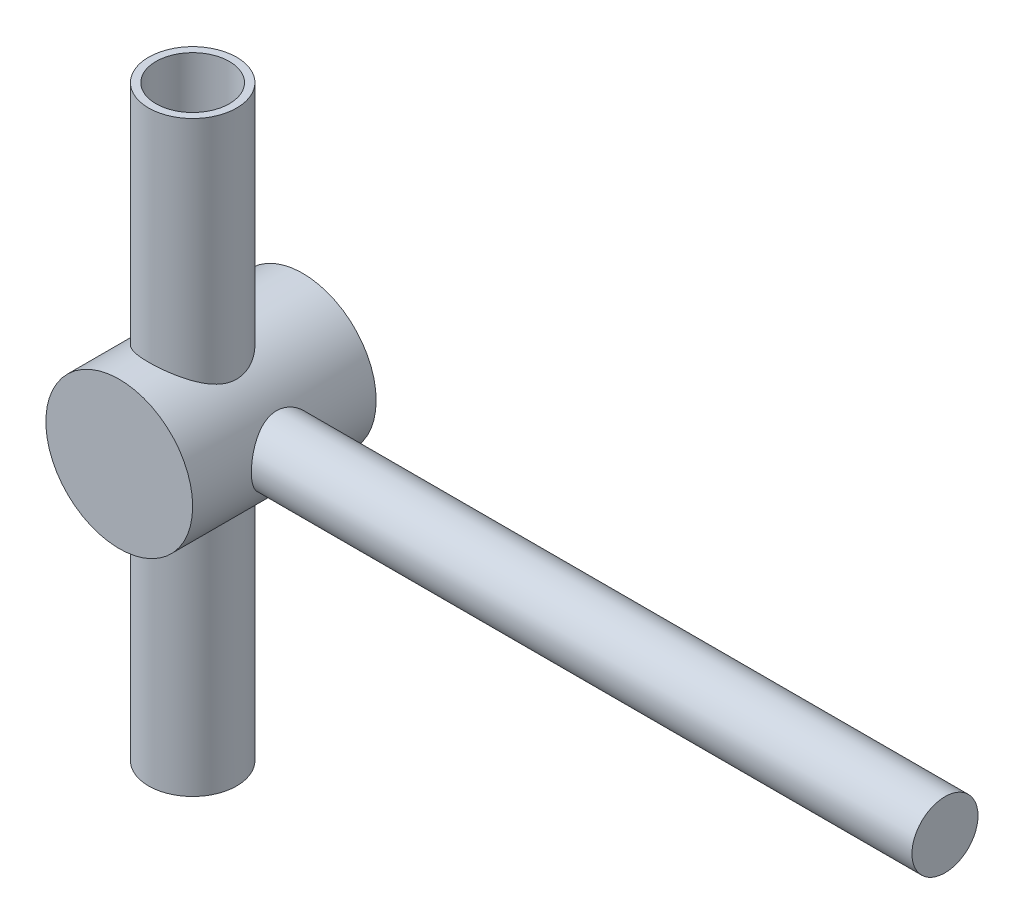
ISO-10303-21;
HEADER;
FILE_DESCRIPTION(('STEP AP214'),'2;1');
FILE_NAME('part.step','',(''),(''),'','','');
FILE_SCHEMA(('AUTOMOTIVE_DESIGN { 1 0 10303 214 1 1 1 1 }'));
ENDSEC;
DATA;
#1=APPLICATION_CONTEXT('core data for automotive mechanical design processes');
#2=APPLICATION_PROTOCOL_DEFINITION('international standard','automotive_design',2000,#1);
#3=PRODUCT_CONTEXT('',#1,'mechanical');
#4=PRODUCT('Part','Part','',(#3));
#5=PRODUCT_RELATED_PRODUCT_CATEGORY('part','',(#4));
#6=PRODUCT_DEFINITION_FORMATION('','',#4);
#7=PRODUCT_DEFINITION_CONTEXT('part definition',#1,'design');
#8=PRODUCT_DEFINITION('design','',#6,#7);
#9=PRODUCT_DEFINITION_SHAPE('','',#8);
#10=(LENGTH_UNIT() NAMED_UNIT(*) SI_UNIT(.MILLI.,.METRE.));
#11=(NAMED_UNIT(*) PLANE_ANGLE_UNIT() SI_UNIT($,.RADIAN.));
#12=(NAMED_UNIT(*) SI_UNIT($,.STERADIAN.) SOLID_ANGLE_UNIT());
#13=UNCERTAINTY_MEASURE_WITH_UNIT(LENGTH_MEASURE(1.E-05),#10,'distance_accuracy_value','');
#14=(GEOMETRIC_REPRESENTATION_CONTEXT(3) GLOBAL_UNCERTAINTY_ASSIGNED_CONTEXT((#13)) GLOBAL_UNIT_ASSIGNED_CONTEXT((#10,
#11,#12)) REPRESENTATION_CONTEXT('',''));
#15=CARTESIAN_POINT('',(0.,0.,0.));
#16=DIRECTION('',(0.,0.,1.));
#17=DIRECTION('',(1.,0.,0.));
#18=AXIS2_PLACEMENT_3D('',#15,#16,#17);
#19=CARTESIAN_POINT('',(0.,20.001,1.25));
#20=DIRECTION('',(0.,-1.,0.));
#21=DIRECTION('',(0.,0.,-1.));
#22=AXIS2_PLACEMENT_3D('',#19,#20,#21);
#23=CYLINDRICAL_SURFACE('',#22,2.5);
#24=CARTESIAN_POINT('',(0.,20.,1.25));
#25=DIRECTION('',(0.,1.,0.));
#26=DIRECTION('',(0.,0.,1.));
#27=AXIS2_PLACEMENT_3D('',#24,#25,#26);
#28=CIRCLE('',#27,2.5);
#29=CARTESIAN_POINT('',(0.,20.,3.75));
#30=VERTEX_POINT('',#29);
#31=EDGE_CURVE('E71',#30,#30,#28,.T.);
#32=ORIENTED_EDGE('',*,*,#31,.T.);
#33=EDGE_LOOP('',(#32));
#34=FACE_BOUND('',#33,.T.);
#35=CARTESIAN_POINT('',(0.,3.75,-1.25));
#36=CARTESIAN_POINT('',(0.125601374662479,3.7499987655971,-1.24999844522486));
#37=CARTESIAN_POINT('',(0.251210147375107,3.74363456413888,-1.24048193681508));
#38=CARTESIAN_POINT('',(0.498417534655946,3.7188086257994,-1.20300452089375));
#39=CARTESIAN_POINT('',(0.620014216592752,3.7003411455889,-1.17503485682461));
#40=CARTESIAN_POINT('',(0.855265062174912,3.65313090481999,-1.10236519336202));
#41=CARTESIAN_POINT('',(0.968953504127329,3.62443628501457,-1.0577435320027));
#42=CARTESIAN_POINT('',(1.18676920045378,3.55907675712476,-0.953670838904247));
#43=CARTESIAN_POINT('',(1.29089506362946,3.52241069193042,-0.894217654082859));
#44=CARTESIAN_POINT('',(1.49660584979873,3.44034160696704,-0.756678815317382));
#45=CARTESIAN_POINT('',(1.59722537477683,3.39446121700526,-0.677440170576138));
#46=CARTESIAN_POINT('',(1.78466006292512,3.2997789162835,-0.505337442677234));
#47=CARTESIAN_POINT('',(1.87145507131621,3.25097288024374,-0.412453838703281));
#48=CARTESIAN_POINT('',(2.0427787194828,3.146603307578,-0.198684539325881));
#49=CARTESIAN_POINT('',(2.12478982891588,3.09118834898155,-0.0756929331889074));
#50=CARTESIAN_POINT('',(2.2668794632946,2.98855184215071,0.18545422175192));
#51=CARTESIAN_POINT('',(2.32699591797102,2.94131619949061,0.323583001883774));
#52=CARTESIAN_POINT('',(2.40842543754358,2.87470333297752,0.570889116826573));
#53=CARTESIAN_POINT('',(2.43593059042228,2.85122034863728,0.676910566107014));
#54=CARTESIAN_POINT('',(2.47688272234313,2.81572462076277,0.893430630912453));
#55=CARTESIAN_POINT('',(2.4903539331615,2.80369210933207,1.00392118589857));
#56=CARTESIAN_POINT('',(2.50239205175334,2.79295757007021,1.22684347357962));
#57=CARTESIAN_POINT('',(2.50089803644892,2.79431003187748,1.33928127933699));
#58=CARTESIAN_POINT('',(2.48296976668709,2.8102471936467,1.56204371685318));
#59=CARTESIAN_POINT('',(2.46652285482348,2.82484310397133,1.67236647745813));
#60=CARTESIAN_POINT('',(2.42081242764785,2.86408982450889,1.88308381414061));
#61=CARTESIAN_POINT('',(2.39214639324732,2.88826860271568,1.98370167022043));
#62=CARTESIAN_POINT('',(2.32337648204614,2.94387028531605,2.1787796140132));
#63=CARTESIAN_POINT('',(2.28326884153759,2.97529557279046,2.27323766287964));
#64=CARTESIAN_POINT('',(2.1834227342476,3.04955245519594,2.47378174408541));
#65=CARTESIAN_POINT('',(2.12135065377971,3.09340397188508,2.57832487557415));
#66=CARTESIAN_POINT('',(1.98336200545358,3.18364422154056,2.77672924413694));
#67=CARTESIAN_POINT('',(1.90742836248812,3.23003603382942,2.87057707221127));
#68=CARTESIAN_POINT('',(1.72476456653744,3.33179179709175,3.06567818199372));
#69=CARTESIAN_POINT('',(1.61492422854798,3.38693430901902,3.16416756085065));
#70=CARTESIAN_POINT('',(1.37750999884782,3.49022625830314,3.34149561817591));
#71=CARTESIAN_POINT('',(1.24995287417908,3.53838222059764,3.4203526817619));
#72=CARTESIAN_POINT('',(1.00607228387111,3.61431755113188,3.54184714827805));
#73=CARTESIAN_POINT('',(0.892447054215008,3.64424076456987,3.58855420417353));
#74=CARTESIAN_POINT('',(0.657545054919234,3.69384648788061,3.66513115703186));
#75=CARTESIAN_POINT('',(0.536274848752032,3.71353765159413,3.69501528391531));
#76=CARTESIAN_POINT('',(0.288731816465386,3.74094852696027,3.73645145654746));
#77=CARTESIAN_POINT('',(0.162439764917713,3.74861653076488,3.74792432617282));
#78=CARTESIAN_POINT('',(-0.0905518992366955,3.75103893706429,3.75155886070277));
#79=CARTESIAN_POINT('',(-0.217251482733301,3.74579424232041,3.74372187561098));
#80=CARTESIAN_POINT('',(-0.458069646505276,3.72374486780342,3.71046993054755));
#81=CARTESIAN_POINT('',(-0.572446805848923,3.70777807987784,3.68632837780595));
#82=CARTESIAN_POINT('',(-0.795145490534314,3.66648061606044,3.62300539248395));
#83=CARTESIAN_POINT('',(-0.903466046964159,3.64114844683731,3.58382156133983));
#84=CARTESIAN_POINT('',(-1.11833093808224,3.58120440661452,3.48918462869376));
#85=CARTESIAN_POINT('',(-1.22437023078828,3.5461233766975,3.43288980739732));
#86=CARTESIAN_POINT('',(-1.42585377994761,3.47002319514369,3.30695838756752));
#87=CARTESIAN_POINT('',(-1.52129143525484,3.42900038004855,3.23731354933614));
#88=CARTESIAN_POINT('',(-1.71481806852475,3.33693183316869,3.07424016480155));
#89=CARTESIAN_POINT('',(-1.81093984460234,3.28532696000533,2.97879217489989));
#90=CARTESIAN_POINT('',(-1.98667460088534,3.1821396635712,2.77361071255986));
#91=CARTESIAN_POINT('',(-2.06627617078001,3.13055728021079,2.6638674511391));
#92=CARTESIAN_POINT('',(-2.20155970680725,3.03674598714348,2.44107198401835));
#93=CARTESIAN_POINT('',(-2.25869545135382,2.99409496286157,2.32908495809515));
#94=CARTESIAN_POINT('',(-2.35620267196513,2.9179871782867,2.09515918452241));
#95=CARTESIAN_POINT('',(-2.39660432181497,2.88451390647318,1.97323882740531));
#96=CARTESIAN_POINT('',(-2.4529480426708,2.83666510240559,1.7442943907711));
#97=CARTESIAN_POINT('',(-2.47198246736887,2.81993747568526,1.63853523685261));
#98=CARTESIAN_POINT('',(-2.4962400762487,2.79849333006088,1.42428339915352));
#99=CARTESIAN_POINT('',(-2.50147826174327,2.79376376529467,1.31579381404578));
#100=CARTESIAN_POINT('',(-2.49779901658417,2.79705251592872,1.09919617612347));
#101=CARTESIAN_POINT('',(-2.48887320407014,2.80507837964135,0.991088387194108));
#102=CARTESIAN_POINT('',(-2.45746249587724,2.83263064923783,0.778320600438362));
#103=CARTESIAN_POINT('',(-2.434959510753,2.85217239741457,0.673665399183417));
#104=CARTESIAN_POINT('',(-2.36991280115224,2.9065855762677,0.442860964386077));
#105=CARTESIAN_POINT('',(-2.32362673285444,2.94415428483887,0.31841513859536));
#106=CARTESIAN_POINT('',(-2.21355718508727,3.0277768987025,0.0806416775555785));
#107=CARTESIAN_POINT('',(-2.14974913954079,3.07384268703843,-0.032670042385189));
#108=CARTESIAN_POINT('',(-2.0049761800668,3.17021527415998,-0.249103204134624));
#109=CARTESIAN_POINT('',(-1.9237201109137,3.22058400672638,-0.35200161476858));
#110=CARTESIAN_POINT('',(-1.74590586583933,3.32035210438942,-0.544149913855851));
#111=CARTESIAN_POINT('',(-1.64934300170333,3.36975116726592,-0.633395604199278));
#112=CARTESIAN_POINT('',(-1.4267842240515,3.47040151023036,-0.808403729442049));
#113=CARTESIAN_POINT('',(-1.29855304909225,3.52090087508118,-0.89182743680491));
#114=CARTESIAN_POINT('',(-1.09415972519334,3.58754498626928,-0.999166107287314));
#115=CARTESIAN_POINT('',(-1.0240248219925,3.60824136009039,-1.03197827055557));
#116=CARTESIAN_POINT('',(-0.880185986539609,3.6459974834269,-1.09122204927387));
#117=CARTESIAN_POINT('',(-0.806483318581939,3.66305850977514,-1.11765590539212));
#118=CARTESIAN_POINT('',(-0.614355982978067,3.70124643764869,-1.17641240787363));
#119=CARTESIAN_POINT('',(-0.493782057953473,3.71938704111942,-1.20388054231437));
#120=CARTESIAN_POINT('',(-0.24880587617304,3.74375996040397,-1.24066829102143));
#121=CARTESIAN_POINT('',(-0.124406567070928,3.7500012226604,-1.25000153998504));
#122=CARTESIAN_POINT('',(0.,3.75,-1.25));
#123=B_SPLINE_CURVE_WITH_KNOTS('',3,(#35,#36,#37,#38,#39,#40,#41,#42,#43,#44,#45,#46,#47,#48,
#49,#50,#51,#52,#53,#54,#55,#56,#57,#58,#59,#60,#61,#62,#63,#64,#65,#66,#67,#68,#69,#70,#71,#72,
#73,#74,#75,#76,#77,#78,#79,#80,#81,#82,#83,#84,#85,#86,#87,#88,#89,#90,#91,#92,#93,#94,#95,#96,
#97,#98,#99,#100,#101,#102,#103,#104,#105,#106,#107,#108,#109,#110,#111,#112,#113,#114,#115,
#116,#117,#118,#119,#120,#121,#122),.UNSPECIFIED.,.T.,.F.,(4,2,2,2,2,2,2,2,2,2,2,2,2,2,2,2,2,2,
2,2,2,2,2,2,2,2,2,2,2,2,2,2,2,2,2,2,2,2,2,2,2,2,2,4),(0.,0.376316533131749,0.75281176793586,
1.12755769148779,1.50235804834233,1.90896286250696,2.31615514505398,2.78758354119978,
3.25819131806799,3.59292117095036,3.92707209807261,4.26258389669222,4.5983799657919,
4.91936077752086,5.24044729764504,5.62684468334248,6.01372129733227,6.48398693129096,
6.95381050384859,7.33155109629103,7.70897168936672,8.08801104125969,8.46702389424924,
8.81941355998746,9.17185943930994,9.54565433545051,9.9196806868966,10.3528522018477,
10.7863219147785,11.1831241913875,11.5792078330906,11.9040506002832,12.2285400042452,
12.5532215036384,12.8783365482366,13.290082608884,13.702408917306,14.1222405651376,
14.5422010497084,15.0224418945669,15.2625373178026,15.5025482734883,15.8755655835623,
16.2483023322226),.UNSPECIFIED.);
#124=CARTESIAN_POINT('',(0.,3.75,3.75));
#125=VERTEX_POINT('',#124);
#126=EDGE_CURVE('E11',#125,#125,#123,.T.);
#127=ORIENTED_EDGE('',*,*,#126,.T.);
#128=EDGE_LOOP('',(#127));
#129=FACE_BOUND('',#128,.T.);
#130=ADVANCED_FACE('F34',(#34,#129),#23,.F.);
#131=CARTESIAN_POINT('',(0.,-20.,1.25));
#132=DIRECTION('',(0.,1.,0.));
#133=DIRECTION('',(0.,0.,1.));
#134=AXIS2_PLACEMENT_3D('',#131,#132,#133);
#135=CIRCLE('',#134,2.5);
#136=CARTESIAN_POINT('',(0.,-20.,3.75));
#137=VERTEX_POINT('',#136);
#138=EDGE_CURVE('E60',#137,#137,#135,.T.);
#139=ORIENTED_EDGE('',*,*,#138,.F.);
#140=EDGE_LOOP('',(#139));
#141=FACE_BOUND('',#140,.T.);
#142=CARTESIAN_POINT('',(0.,-3.75,-1.25));
#143=CARTESIAN_POINT('',(-0.125601374662479,-3.7499987655971,-1.24999844522486));
#144=CARTESIAN_POINT('',(-0.251210147375107,-3.74363456413888,-1.24048193681508));
#145=CARTESIAN_POINT('',(-0.498417534655946,-3.7188086257994,-1.20300452089375));
#146=CARTESIAN_POINT('',(-0.620014216592752,-3.7003411455889,-1.17503485682461));
#147=CARTESIAN_POINT('',(-0.855265062174912,-3.65313090481999,-1.10236519336202));
#148=CARTESIAN_POINT('',(-0.968953504127329,-3.62443628501457,-1.0577435320027));
#149=CARTESIAN_POINT('',(-1.18676920045378,-3.55907675712476,-0.953670838904247));
#150=CARTESIAN_POINT('',(-1.29089506362946,-3.52241069193042,-0.894217654082859));
#151=CARTESIAN_POINT('',(-1.49660584979873,-3.44034160696704,-0.756678815317382));
#152=CARTESIAN_POINT('',(-1.59722537477683,-3.39446121700526,-0.677440170576138));
#153=CARTESIAN_POINT('',(-1.78466006292512,-3.2997789162835,-0.505337442677234));
#154=CARTESIAN_POINT('',(-1.87145507131621,-3.25097288024374,-0.412453838703281));
#155=CARTESIAN_POINT('',(-2.0427787194828,-3.146603307578,-0.198684539325881));
#156=CARTESIAN_POINT('',(-2.12478982891588,-3.09118834898155,-0.0756929331889074));
#157=CARTESIAN_POINT('',(-2.2668794632946,-2.98855184215071,0.18545422175192));
#158=CARTESIAN_POINT('',(-2.32699591797102,-2.94131619949061,0.323583001883774));
#159=CARTESIAN_POINT('',(-2.40842543754358,-2.87470333297752,0.570889116826573));
#160=CARTESIAN_POINT('',(-2.43593059042228,-2.85122034863728,0.676910566107014));
#161=CARTESIAN_POINT('',(-2.47688272234313,-2.81572462076277,0.893430630912453));
#162=CARTESIAN_POINT('',(-2.4903539331615,-2.80369210933207,1.00392118589857));
#163=CARTESIAN_POINT('',(-2.50239205175334,-2.79295757007021,1.22684347357962));
#164=CARTESIAN_POINT('',(-2.50089803644892,-2.79431003187748,1.33928127933699));
#165=CARTESIAN_POINT('',(-2.48296976668709,-2.8102471936467,1.56204371685318));
#166=CARTESIAN_POINT('',(-2.46652285482348,-2.82484310397133,1.67236647745813));
#167=CARTESIAN_POINT('',(-2.42081242764785,-2.86408982450889,1.88308381414061));
#168=CARTESIAN_POINT('',(-2.39214639324732,-2.88826860271568,1.98370167022043));
#169=CARTESIAN_POINT('',(-2.32337648204614,-2.94387028531605,2.1787796140132));
#170=CARTESIAN_POINT('',(-2.28326884153759,-2.97529557279046,2.27323766287964));
#171=CARTESIAN_POINT('',(-2.1834227342476,-3.04955245519594,2.47378174408541));
#172=CARTESIAN_POINT('',(-2.12135065377971,-3.09340397188508,2.57832487557415));
#173=CARTESIAN_POINT('',(-1.98336200545358,-3.18364422154056,2.77672924413694));
#174=CARTESIAN_POINT('',(-1.90742836248812,-3.23003603382942,2.87057707221127));
#175=CARTESIAN_POINT('',(-1.72476456653744,-3.33179179709175,3.06567818199372));
#176=CARTESIAN_POINT('',(-1.61492422854798,-3.38693430901902,3.16416756085065));
#177=CARTESIAN_POINT('',(-1.37750999884782,-3.49022625830314,3.34149561817591));
#178=CARTESIAN_POINT('',(-1.24995287417908,-3.53838222059764,3.4203526817619));
#179=CARTESIAN_POINT('',(-1.00607228387111,-3.61431755113188,3.54184714827805));
#180=CARTESIAN_POINT('',(-0.892447054215008,-3.64424076456987,3.58855420417353));
#181=CARTESIAN_POINT('',(-0.657545054919234,-3.69384648788061,3.66513115703186));
#182=CARTESIAN_POINT('',(-0.536274848752032,-3.71353765159413,3.69501528391531));
#183=CARTESIAN_POINT('',(-0.288731816465386,-3.74094852696027,3.73645145654746));
#184=CARTESIAN_POINT('',(-0.162439764917713,-3.74861653076488,3.74792432617282));
#185=CARTESIAN_POINT('',(0.0905518992366955,-3.75103893706429,3.75155886070277));
#186=CARTESIAN_POINT('',(0.217251482733301,-3.74579424232041,3.74372187561098));
#187=CARTESIAN_POINT('',(0.458069646505276,-3.72374486780342,3.71046993054755));
#188=CARTESIAN_POINT('',(0.572446805848923,-3.70777807987784,3.68632837780595));
#189=CARTESIAN_POINT('',(0.795145490534314,-3.66648061606044,3.62300539248395));
#190=CARTESIAN_POINT('',(0.903466046964159,-3.64114844683731,3.58382156133983));
#191=CARTESIAN_POINT('',(1.11833093808224,-3.58120440661452,3.48918462869376));
#192=CARTESIAN_POINT('',(1.22437023078828,-3.5461233766975,3.43288980739732));
#193=CARTESIAN_POINT('',(1.42585377994761,-3.47002319514369,3.30695838756752));
#194=CARTESIAN_POINT('',(1.52129143525484,-3.42900038004855,3.23731354933614));
#195=CARTESIAN_POINT('',(1.71481806852475,-3.33693183316869,3.07424016480155));
#196=CARTESIAN_POINT('',(1.81093984460234,-3.28532696000533,2.97879217489989));
#197=CARTESIAN_POINT('',(1.98667460088534,-3.1821396635712,2.77361071255986));
#198=CARTESIAN_POINT('',(2.06627617078001,-3.13055728021079,2.6638674511391));
#199=CARTESIAN_POINT('',(2.20155970680725,-3.03674598714348,2.44107198401835));
#200=CARTESIAN_POINT('',(2.25869545135382,-2.99409496286157,2.32908495809515));
#201=CARTESIAN_POINT('',(2.35620267196513,-2.9179871782867,2.09515918452241));
#202=CARTESIAN_POINT('',(2.39660432181497,-2.88451390647318,1.97323882740531));
#203=CARTESIAN_POINT('',(2.4529480426708,-2.83666510240559,1.7442943907711));
#204=CARTESIAN_POINT('',(2.47198246736887,-2.81993747568526,1.63853523685261));
#205=CARTESIAN_POINT('',(2.4962400762487,-2.79849333006088,1.42428339915352));
#206=CARTESIAN_POINT('',(2.50147826174327,-2.79376376529467,1.31579381404578));
#207=CARTESIAN_POINT('',(2.49779901658417,-2.79705251592872,1.09919617612347));
#208=CARTESIAN_POINT('',(2.48887320407014,-2.80507837964135,0.991088387194108));
#209=CARTESIAN_POINT('',(2.45746249587724,-2.83263064923783,0.778320600438362));
#210=CARTESIAN_POINT('',(2.434959510753,-2.85217239741457,0.673665399183417));
#211=CARTESIAN_POINT('',(2.36991280115224,-2.9065855762677,0.442860964386077));
#212=CARTESIAN_POINT('',(2.32362673285444,-2.94415428483887,0.31841513859536));
#213=CARTESIAN_POINT('',(2.21355718508727,-3.0277768987025,0.0806416775555785));
#214=CARTESIAN_POINT('',(2.14974913954079,-3.07384268703843,-0.032670042385189));
#215=CARTESIAN_POINT('',(2.0049761800668,-3.17021527415998,-0.249103204134624));
#216=CARTESIAN_POINT('',(1.9237201109137,-3.22058400672638,-0.35200161476858));
#217=CARTESIAN_POINT('',(1.74590586583933,-3.32035210438942,-0.544149913855851));
#218=CARTESIAN_POINT('',(1.64934300170333,-3.36975116726592,-0.633395604199278));
#219=CARTESIAN_POINT('',(1.4267842240515,-3.47040151023036,-0.808403729442049));
#220=CARTESIAN_POINT('',(1.29855304909225,-3.52090087508118,-0.89182743680491));
#221=CARTESIAN_POINT('',(1.09415972519334,-3.58754498626928,-0.999166107287314));
#222=CARTESIAN_POINT('',(1.0240248219925,-3.60824136009039,-1.03197827055557));
#223=CARTESIAN_POINT('',(0.880185986539609,-3.6459974834269,-1.09122204927387));
#224=CARTESIAN_POINT('',(0.806483318581939,-3.66305850977514,-1.11765590539212));
#225=CARTESIAN_POINT('',(0.614355982978067,-3.70124643764869,-1.17641240787363));
#226=CARTESIAN_POINT('',(0.493782057953473,-3.71938704111942,-1.20388054231437));
#227=CARTESIAN_POINT('',(0.24880587617304,-3.74375996040397,-1.24066829102143));
#228=CARTESIAN_POINT('',(0.124406567070928,-3.7500012226604,-1.25000153998504));
#229=CARTESIAN_POINT('',(0.,-3.75,-1.25));
#230=B_SPLINE_CURVE_WITH_KNOTS('',3,(#142,#143,#144,#145,#146,#147,#148,#149,#150,#151,#152,
#153,#154,#155,#156,#157,#158,#159,#160,#161,#162,#163,#164,#165,#166,#167,#168,#169,#170,#171,
#172,#173,#174,#175,#176,#177,#178,#179,#180,#181,#182,#183,#184,#185,#186,#187,#188,#189,#190,
#191,#192,#193,#194,#195,#196,#197,#198,#199,#200,#201,#202,#203,#204,#205,#206,#207,#208,#209,
#210,#211,#212,#213,#214,#215,#216,#217,#218,#219,#220,#221,#222,#223,#224,#225,#226,#227,#228,
#229),.UNSPECIFIED.,.T.,.F.,(4,2,2,2,2,2,2,2,2,2,2,2,2,2,2,2,2,2,2,2,2,2,2,2,2,2,2,2,2,2,2,2,2,
2,2,2,2,2,2,2,2,2,2,4),(0.,0.376316533131749,0.75281176793586,1.12755769148779,1.50235804834233,
1.90896286250696,2.31615514505398,2.78758354119978,3.25819131806799,3.59292117095036,
3.92707209807261,4.26258389669222,4.5983799657919,4.91936077752086,5.24044729764504,
5.62684468334248,6.01372129733227,6.48398693129096,6.95381050384859,7.33155109629103,
7.70897168936672,8.08801104125969,8.46702389424924,8.81941355998746,9.17185943930994,
9.54565433545051,9.9196806868966,10.3528522018477,10.7863219147785,11.1831241913875,
11.5792078330906,11.9040506002832,12.2285400042452,12.5532215036384,12.8783365482366,
13.290082608884,13.702408917306,14.1222405651376,14.5422010497084,15.0224418945669,
15.2625373178026,15.5025482734883,15.8755655835623,16.2483023322226),.UNSPECIFIED.);
#231=CARTESIAN_POINT('',(0.,-3.75,3.75));
#232=VERTEX_POINT('',#231);
#233=EDGE_CURVE('E47',#232,#232,#230,.T.);
#234=ORIENTED_EDGE('',*,*,#233,.T.);
#235=EDGE_LOOP('',(#234));
#236=FACE_BOUND('',#235,.T.);
#237=ADVANCED_FACE('F122',(#141,#236),#23,.F.);
#238=CARTESIAN_POINT('',(0.,0.,6.25));
#239=DIRECTION('',(0.,0.,-1.));
#240=DIRECTION('',(-1.,0.,0.));
#241=AXIS2_PLACEMENT_3D('',#238,#239,#240);
#242=CYLINDRICAL_SURFACE('',#241,5.);
#243=CARTESIAN_POINT('',(0.,0.,6.25));
#244=DIRECTION('',(0.,0.,1.));
#245=DIRECTION('',(1.,0.,0.));
#246=AXIS2_PLACEMENT_3D('',#243,#244,#245);
#247=CIRCLE('',#246,5.);
#248=CARTESIAN_POINT('',(5.,0.,6.25));
#249=VERTEX_POINT('',#248);
#250=EDGE_CURVE('E84',#249,#249,#247,.T.);
#251=ORIENTED_EDGE('',*,*,#250,.F.);
#252=EDGE_LOOP('',(#251));
#253=FACE_BOUND('',#252,.T.);
#254=CARTESIAN_POINT('',(0.,0.,-6.25));
#255=DIRECTION('',(0.,0.,1.));
#256=DIRECTION('',(1.,0.,0.));
#257=AXIS2_PLACEMENT_3D('',#254,#255,#256);
#258=CIRCLE('',#257,5.);
#259=CARTESIAN_POINT('',(5.,0.,-6.25));
#260=VERTEX_POINT('',#259);
#261=EDGE_CURVE('E81',#260,#260,#258,.T.);
#262=ORIENTED_EDGE('',*,*,#261,.T.);
#263=EDGE_LOOP('',(#262));
#264=FACE_BOUND('',#263,.T.);
#265=CARTESIAN_POINT('',(0.,-5.,-1.75));
#266=CARTESIAN_POINT('',(0.0767697294351705,-4.99999907546385,-1.74999894375546));
#267=CARTESIAN_POINT('',(0.153562134518387,-4.99822567812271,-1.74704640642993));
#268=CARTESIAN_POINT('',(0.306548487758715,-4.99118362570631,-1.73528576702026));
#269=CARTESIAN_POINT('',(0.382742059346592,-4.98591292553957,-1.72647423881177));
#270=CARTESIAN_POINT('',(0.609808130024627,-4.96499345352549,-1.69135144053687));
#271=CARTESIAN_POINT('',(0.758981863291667,-4.94423772571335,-1.65635229756656));
#272=CARTESIAN_POINT('',(1.04754167363585,-4.89123238995897,-1.56522725649588));
#273=CARTESIAN_POINT('',(1.18697226741342,-4.8590397955111,-1.50920607798726));
#274=CARTESIAN_POINT('',(1.45405042800218,-4.7859070225578,-1.37827933940296));
#275=CARTESIAN_POINT('',(1.58170090938261,-4.74496901614699,-1.30337846763984));
#276=CARTESIAN_POINT('',(1.83260160381823,-4.65410731283371,-1.13045034488488));
#277=CARTESIAN_POINT('',(1.95476885986166,-4.60373587041895,-1.03109260883346));
#278=CARTESIAN_POINT('',(2.1817645874806,-4.50060875905921,-0.815065592807814));
#279=CARTESIAN_POINT('',(2.28657046750404,-4.4478500955754,-0.698374125781651));
#280=CARTESIAN_POINT('',(2.48890019509837,-4.33822134833335,-0.434152978831089));
#281=CARTESIAN_POINT('',(2.5839553962784,-4.28164035635797,-0.284596457877819));
#282=CARTESIAN_POINT('',(2.74722868670785,-4.17876602596121,0.0316931463268839));
#283=CARTESIAN_POINT('',(2.8154903315581,-4.13245604474886,0.198397792033157));
#284=CARTESIAN_POINT('',(2.90881204577224,-4.06709259377223,0.503192901656898));
#285=CARTESIAN_POINT('',(2.94032394587637,-4.04415766338645,0.638471998361388));
#286=CARTESIAN_POINT('',(2.98432344587083,-4.01180616527622,0.913607430521392));
#287=CARTESIAN_POINT('',(2.99683469884359,-4.00237279089368,1.05345785330403));
#288=CARTESIAN_POINT('',(3.0021101681982,-3.99841845126251,1.33402299264786));
#289=CARTESIAN_POINT('',(2.99483563630785,-4.00392674756739,1.47473886591187));
#290=CARTESIAN_POINT('',(2.96092124146105,-4.02906522155629,1.75255753511786));
#291=CARTESIAN_POINT('',(2.93426681225441,-4.04870602134773,1.88965753294149));
#292=CARTESIAN_POINT('',(2.86347831933193,-4.09906376582929,2.15506054225054));
#293=CARTESIAN_POINT('',(2.8195745342289,-4.12963433300037,2.28345432299445));
#294=CARTESIAN_POINT('',(2.71590167467071,-4.19854092703026,2.5313897666318));
#295=CARTESIAN_POINT('',(2.65612678414159,-4.2368797994146,2.65092816382902));
#296=CARTESIAN_POINT('',(2.51035773820671,-4.32510698365561,2.89996913765634));
#297=CARTESIAN_POINT('',(2.42160671901867,-4.3758426358075,3.02755999236773));
#298=CARTESIAN_POINT('',(2.22582963207776,-4.4786102252415,3.26734915722012));
#299=CARTESIAN_POINT('',(2.11878609335504,-4.53064336077654,3.37953256540213));
#300=CARTESIAN_POINT('',(1.87159040921357,-4.63871766962914,3.60124225944849));
#301=CARTESIAN_POINT('',(1.72890315178768,-4.69430681953073,3.70821939123735));
#302=CARTESIAN_POINT('',(1.50061053630278,-4.77018325995047,3.84926871272286));
#303=CARTESIAN_POINT('',(1.42209821815681,-4.79423315237467,3.89306413551611));
#304=CARTESIAN_POINT('',(1.26074368673913,-4.83916496756429,3.973718823611));
#305=CARTESIAN_POINT('',(1.17790417501176,-4.86004883588963,4.0105823520208));
#306=CARTESIAN_POINT('',(1.01376371174001,-4.8968267274493,4.07481144285664));
#307=CARTESIAN_POINT('',(0.932690066663956,-4.91295100454953,4.10262656044921));
#308=CARTESIAN_POINT('',(0.767879949732825,-4.94139126794745,4.15133395584523));
#309=CARTESIAN_POINT('',(0.684144997174637,-4.95370938553284,4.17223010844636));
#310=CARTESIAN_POINT('',(0.514744462654423,-4.97416370514887,4.20677185472476));
#311=CARTESIAN_POINT('',(0.429080341969609,-4.98230296820872,4.22042275582861));
#312=CARTESIAN_POINT('',(0.256621746592206,-4.99415996414414,4.2402661843902));
#313=CARTESIAN_POINT('',(0.169827432617758,-4.99787831889699,4.24645976085132));
#314=CARTESIAN_POINT('',(-0.0673242571106438,-5.00179157954795,4.25299267028363));
#315=CARTESIAN_POINT('',(-0.218056842610662,-4.99746512571837,4.2458115456306));
#316=CARTESIAN_POINT('',(-0.515686907628998,-4.97557955020067,4.2091544582709));
#317=CARTESIAN_POINT('',(-0.662584464852967,-4.95802069684413,4.17967894765814));
#318=CARTESIAN_POINT('',(-0.945142599254814,-4.91189447655688,4.10091154081572));
#319=CARTESIAN_POINT('',(-1.08098954856944,-4.88360514429733,4.05211887340799));
#320=CARTESIAN_POINT('',(-1.34253345184752,-4.81827798628348,3.93664567579909));
#321=CARTESIAN_POINT('',(-1.46822839746276,-4.78123843515362,3.86996161740593));
#322=CARTESIAN_POINT('',(-1.7200119213015,-4.69690981059277,3.71288590902203));
#323=CARTESIAN_POINT('',(-1.84478813824221,-4.6489560240695,3.62075230616252));
#324=CARTESIAN_POINT('',(-2.07805222548222,-4.54948534225871,3.41921724874524));
#325=CARTESIAN_POINT('',(-2.18652085154156,-4.49796434043363,3.30979570039729));
#326=CARTESIAN_POINT('',(-2.39863988264158,-4.38890846835682,3.06017920850684));
#327=CARTESIAN_POINT('',(-2.49982037884172,-4.33146483230154,2.91783222605696));
#328=CARTESIAN_POINT('',(-2.67690479207535,-4.22432364395571,2.61556795387244));
#329=CARTESIAN_POINT('',(-2.75283533845462,-4.1746179606141,2.45566941284875));
#330=CARTESIAN_POINT('',(-2.86285157351706,-4.09969818429266,2.15751395488928));
#331=CARTESIAN_POINT('',(-2.90243250662613,-4.07151318633887,2.02203937535796));
#332=CARTESIAN_POINT('',(-2.96227327821697,-4.02819211510624,1.74493584376477));
#333=CARTESIAN_POINT('',(-2.98255990395067,-4.01303795327895,1.60331571054848));
#334=CARTESIAN_POINT('',(-3.00268261034206,-3.99800893189922,1.31724610560478));
#335=CARTESIAN_POINT('',(-3.00244179030845,-3.99819152744816,1.1727880217517));
#336=CARTESIAN_POINT('',(-2.98132945103105,-4.01395435932838,0.886211125653601));
#337=CARTESIAN_POINT('',(-2.96044671369591,-4.02954296823692,0.744093628125194));
#338=CARTESIAN_POINT('',(-2.90080351212233,-4.07266369966216,0.473023176004899));
#339=CARTESIAN_POINT('',(-2.86295284328648,-4.09958421715569,0.343765852075642));
#340=CARTESIAN_POINT('',(-2.77126473512031,-4.16211005816609,0.0933254503468499));
#341=CARTESIAN_POINT('',(-2.7174212751772,-4.19771865147484,-0.0278545656129924));
#342=CARTESIAN_POINT('',(-2.58578536859698,-4.28025972950371,-0.278639539459991));
#343=CARTESIAN_POINT('',(-2.50558518231556,-4.32809142579694,-0.406681508214769));
#344=CARTESIAN_POINT('',(-2.32751213746957,-4.42640286674054,-0.6487608453066));
#345=CARTESIAN_POINT('',(-2.22962472612067,-4.47688476749088,-0.76278655047955));
#346=CARTESIAN_POINT('',(-2.00020353552556,-4.5845123827036,-0.99269884332947));
#347=CARTESIAN_POINT('',(-1.86578571790514,-4.64140045738634,-1.10584987986161));
#348=CARTESIAN_POINT('',(-1.57689277813436,-4.74731429537958,-1.30820798604814));
#349=CARTESIAN_POINT('',(-1.42241049573676,-4.79633723789531,-1.39740647291971));
#350=CARTESIAN_POINT('',(-1.18102189661685,-4.85920558314903,-1.50912447419053));
#351=CARTESIAN_POINT('',(-1.10025014285135,-4.87817139185349,-1.54233599596449));
#352=CARTESIAN_POINT('',(-0.935442217988384,-4.91243413775203,-1.60177213814346));
#353=CARTESIAN_POINT('',(-0.851407984788099,-4.9277332153652,-1.62800083570093));
#354=CARTESIAN_POINT('',(-0.681001816074564,-4.95415527987996,-1.67300944207575));
#355=CARTESIAN_POINT('',(-0.594637500609289,-4.9652904423195,-1.69181107730331));
#356=CARTESIAN_POINT('',(-0.420183746020759,-4.98308318645254,-1.72174435532299));
#357=CARTESIAN_POINT('',(-0.332095806784394,-4.98974449723791,-1.73288238615331));
#358=CARTESIAN_POINT('',(-0.203123929661336,-4.99603728421477,-1.74339168380533));
#359=CARTESIAN_POINT('',(-0.162556281113487,-4.99752198179196,-1.745868430454));
#360=CARTESIAN_POINT('',(-0.0813278781867665,-4.99950360169341,-1.74917289691394));
#361=CARTESIAN_POINT('',(-0.0406671206271712,-5.00000048975323,-1.75000055952293));
#362=CARTESIAN_POINT('',(0.,-5.,-1.75));
#363=B_SPLINE_CURVE_WITH_KNOTS('',3,(#265,#266,#267,#268,#269,#270,#271,#272,#273,#274,#275,
#276,#277,#278,#279,#280,#281,#282,#283,#284,#285,#286,#287,#288,#289,#290,#291,#292,#293,#294,
#295,#296,#297,#298,#299,#300,#301,#302,#303,#304,#305,#306,#307,#308,#309,#310,#311,#312,#313,
#314,#315,#316,#317,#318,#319,#320,#321,#322,#323,#324,#325,#326,#327,#328,#329,#330,#331,#332,
#333,#334,#335,#336,#337,#338,#339,#340,#341,#342,#343,#344,#345,#346,#347,#348,#349,#350,#351,
#352,#353,#354,#355,#356,#357,#358,#359,#360,#361,#362),.UNSPECIFIED.,.T.,.F.,(4,2,2,2,2,2,2,2,
2,2,2,2,2,2,2,2,2,2,2,2,2,2,2,2,2,2,2,2,2,2,2,2,2,2,2,2,2,2,2,2,2,2,2,2,2,2,2,2,4),(0.,
0.230263300595003,0.4606613693334,0.922002149276126,1.38107466343613,1.84003329022065,
2.33408870888555,2.82878205293211,3.38413315803225,3.93857770807793,4.35913349134877,
4.77916531256766,5.20002031165062,5.62119195971355,6.03692224610024,6.45280509043347,
6.94139679873935,7.43045779030959,7.98767605192993,8.26653157143431,8.54521503013734,
8.80648473589063,9.06760787545943,9.3285394673096,9.58943435026958,10.0398406663534,
10.490237849174,10.9296843257003,11.3692175250854,11.8543559282721,12.3400624135416,
12.889063860465,13.437484464234,13.8674843581987,14.2968863865712,14.7278971274535,
15.1591422350194,15.5696105785277,15.9802336423656,16.4539008129506,16.927959499309,
17.4794148474152,18.0310675325446,18.2988384573895,18.5664526907294,18.8332781687618,
19.0998809626714,19.221853785686,19.3438308395353),.UNSPECIFIED.);
#364=CARTESIAN_POINT('',(0.,-5.,-1.75));
#365=VERTEX_POINT('',#364);
#366=EDGE_CURVE('E87',#365,#365,#363,.T.);
#367=ORIENTED_EDGE('',*,*,#366,.F.);
#368=EDGE_LOOP('',(#367));
#369=FACE_BOUND('',#368,.T.);
#370=CARTESIAN_POINT('',(0.,5.,-1.75));
#371=CARTESIAN_POINT('',(-0.0767697294351705,4.99999907546385,-1.74999894375546));
#372=CARTESIAN_POINT('',(-0.153562134518387,4.99822567812271,-1.74704640642993));
#373=CARTESIAN_POINT('',(-0.306548487758715,4.99118362570631,-1.73528576702026));
#374=CARTESIAN_POINT('',(-0.382742059346592,4.98591292553957,-1.72647423881177));
#375=CARTESIAN_POINT('',(-0.609808130024627,4.96499345352549,-1.69135144053687));
#376=CARTESIAN_POINT('',(-0.758981863291667,4.94423772571335,-1.65635229756656));
#377=CARTESIAN_POINT('',(-1.04754167363585,4.89123238995897,-1.56522725649588));
#378=CARTESIAN_POINT('',(-1.18697226741342,4.8590397955111,-1.50920607798726));
#379=CARTESIAN_POINT('',(-1.45405042800218,4.7859070225578,-1.37827933940296));
#380=CARTESIAN_POINT('',(-1.58170090938261,4.74496901614699,-1.30337846763984));
#381=CARTESIAN_POINT('',(-1.83260160381823,4.65410731283371,-1.13045034488488));
#382=CARTESIAN_POINT('',(-1.95476885986166,4.60373587041895,-1.03109260883346));
#383=CARTESIAN_POINT('',(-2.1817645874806,4.50060875905921,-0.815065592807814));
#384=CARTESIAN_POINT('',(-2.28657046750404,4.4478500955754,-0.698374125781651));
#385=CARTESIAN_POINT('',(-2.48890019509837,4.33822134833335,-0.434152978831089));
#386=CARTESIAN_POINT('',(-2.5839553962784,4.28164035635797,-0.284596457877819));
#387=CARTESIAN_POINT('',(-2.74722868670785,4.17876602596121,0.0316931463268839));
#388=CARTESIAN_POINT('',(-2.8154903315581,4.13245604474886,0.198397792033157));
#389=CARTESIAN_POINT('',(-2.90881204577224,4.06709259377223,0.503192901656898));
#390=CARTESIAN_POINT('',(-2.94032394587637,4.04415766338645,0.638471998361388));
#391=CARTESIAN_POINT('',(-2.98432344587083,4.01180616527622,0.913607430521392));
#392=CARTESIAN_POINT('',(-2.99683469884359,4.00237279089368,1.05345785330403));
#393=CARTESIAN_POINT('',(-3.0021101681982,3.99841845126251,1.33402299264786));
#394=CARTESIAN_POINT('',(-2.99483563630785,4.00392674756739,1.47473886591187));
#395=CARTESIAN_POINT('',(-2.96092124146105,4.02906522155629,1.75255753511786));
#396=CARTESIAN_POINT('',(-2.93426681225441,4.04870602134773,1.88965753294149));
#397=CARTESIAN_POINT('',(-2.86347831933193,4.09906376582929,2.15506054225054));
#398=CARTESIAN_POINT('',(-2.8195745342289,4.12963433300037,2.28345432299445));
#399=CARTESIAN_POINT('',(-2.71590167467071,4.19854092703026,2.5313897666318));
#400=CARTESIAN_POINT('',(-2.65612678414159,4.2368797994146,2.65092816382902));
#401=CARTESIAN_POINT('',(-2.51035773820671,4.32510698365561,2.89996913765634));
#402=CARTESIAN_POINT('',(-2.42160671901867,4.3758426358075,3.02755999236773));
#403=CARTESIAN_POINT('',(-2.22582963207776,4.4786102252415,3.26734915722012));
#404=CARTESIAN_POINT('',(-2.11878609335504,4.53064336077654,3.37953256540213));
#405=CARTESIAN_POINT('',(-1.87159040921357,4.63871766962914,3.60124225944849));
#406=CARTESIAN_POINT('',(-1.72890315178768,4.69430681953073,3.70821939123735));
#407=CARTESIAN_POINT('',(-1.50061053630278,4.77018325995047,3.84926871272286));
#408=CARTESIAN_POINT('',(-1.42209821815681,4.79423315237467,3.89306413551611));
#409=CARTESIAN_POINT('',(-1.26074368673913,4.83916496756429,3.973718823611));
#410=CARTESIAN_POINT('',(-1.17790417501176,4.86004883588963,4.0105823520208));
#411=CARTESIAN_POINT('',(-1.01376371174001,4.8968267274493,4.07481144285664));
#412=CARTESIAN_POINT('',(-0.932690066663956,4.91295100454953,4.10262656044921));
#413=CARTESIAN_POINT('',(-0.767879949732825,4.94139126794745,4.15133395584523));
#414=CARTESIAN_POINT('',(-0.684144997174637,4.95370938553284,4.17223010844636));
#415=CARTESIAN_POINT('',(-0.514744462654423,4.97416370514887,4.20677185472476));
#416=CARTESIAN_POINT('',(-0.429080341969609,4.98230296820872,4.22042275582861));
#417=CARTESIAN_POINT('',(-0.256621746592206,4.99415996414414,4.2402661843902));
#418=CARTESIAN_POINT('',(-0.169827432617758,4.99787831889699,4.24645976085132));
#419=CARTESIAN_POINT('',(0.0673242571106438,5.00179157954795,4.25299267028363));
#420=CARTESIAN_POINT('',(0.218056842610662,4.99746512571837,4.2458115456306));
#421=CARTESIAN_POINT('',(0.515686907628998,4.97557955020067,4.2091544582709));
#422=CARTESIAN_POINT('',(0.662584464852967,4.95802069684413,4.17967894765814));
#423=CARTESIAN_POINT('',(0.945142599254814,4.91189447655688,4.10091154081572));
#424=CARTESIAN_POINT('',(1.08098954856944,4.88360514429733,4.05211887340799));
#425=CARTESIAN_POINT('',(1.34253345184752,4.81827798628348,3.93664567579909));
#426=CARTESIAN_POINT('',(1.46822839746276,4.78123843515362,3.86996161740593));
#427=CARTESIAN_POINT('',(1.7200119213015,4.69690981059277,3.71288590902203));
#428=CARTESIAN_POINT('',(1.84478813824221,4.6489560240695,3.62075230616252));
#429=CARTESIAN_POINT('',(2.07805222548222,4.54948534225871,3.41921724874524));
#430=CARTESIAN_POINT('',(2.18652085154156,4.49796434043363,3.30979570039729));
#431=CARTESIAN_POINT('',(2.39863988264158,4.38890846835682,3.06017920850684));
#432=CARTESIAN_POINT('',(2.49982037884172,4.33146483230154,2.91783222605696));
#433=CARTESIAN_POINT('',(2.67690479207535,4.22432364395571,2.61556795387244));
#434=CARTESIAN_POINT('',(2.75283533845462,4.1746179606141,2.45566941284875));
#435=CARTESIAN_POINT('',(2.86285157351706,4.09969818429266,2.15751395488928));
#436=CARTESIAN_POINT('',(2.90243250662613,4.07151318633887,2.02203937535796));
#437=CARTESIAN_POINT('',(2.96227327821697,4.02819211510624,1.74493584376477));
#438=CARTESIAN_POINT('',(2.98255990395067,4.01303795327895,1.60331571054848));
#439=CARTESIAN_POINT('',(3.00268261034206,3.99800893189922,1.31724610560478));
#440=CARTESIAN_POINT('',(3.00244179030845,3.99819152744816,1.1727880217517));
#441=CARTESIAN_POINT('',(2.98132945103105,4.01395435932838,0.886211125653601));
#442=CARTESIAN_POINT('',(2.96044671369591,4.02954296823692,0.744093628125194));
#443=CARTESIAN_POINT('',(2.90080351212233,4.07266369966216,0.473023176004899));
#444=CARTESIAN_POINT('',(2.86295284328648,4.09958421715569,0.343765852075642));
#445=CARTESIAN_POINT('',(2.77126473512031,4.16211005816609,0.0933254503468499));
#446=CARTESIAN_POINT('',(2.7174212751772,4.19771865147484,-0.0278545656129924));
#447=CARTESIAN_POINT('',(2.58578536859698,4.28025972950371,-0.278639539459991));
#448=CARTESIAN_POINT('',(2.50558518231556,4.32809142579694,-0.406681508214769));
#449=CARTESIAN_POINT('',(2.32751213746957,4.42640286674054,-0.6487608453066));
#450=CARTESIAN_POINT('',(2.22962472612067,4.47688476749088,-0.76278655047955));
#451=CARTESIAN_POINT('',(2.00020353552556,4.5845123827036,-0.99269884332947));
#452=CARTESIAN_POINT('',(1.86578571790514,4.64140045738634,-1.10584987986161));
#453=CARTESIAN_POINT('',(1.57689277813436,4.74731429537958,-1.30820798604814));
#454=CARTESIAN_POINT('',(1.42241049573676,4.79633723789531,-1.39740647291971));
#455=CARTESIAN_POINT('',(1.18102189661685,4.85920558314903,-1.50912447419053));
#456=CARTESIAN_POINT('',(1.10025014285135,4.87817139185349,-1.54233599596449));
#457=CARTESIAN_POINT('',(0.935442217988384,4.91243413775203,-1.60177213814346));
#458=CARTESIAN_POINT('',(0.851407984788099,4.9277332153652,-1.62800083570093));
#459=CARTESIAN_POINT('',(0.681001816074564,4.95415527987996,-1.67300944207575));
#460=CARTESIAN_POINT('',(0.594637500609289,4.9652904423195,-1.69181107730331));
#461=CARTESIAN_POINT('',(0.420183746020759,4.98308318645254,-1.72174435532299));
#462=CARTESIAN_POINT('',(0.332095806784394,4.98974449723791,-1.73288238615331));
#463=CARTESIAN_POINT('',(0.203123929661336,4.99603728421477,-1.74339168380533));
#464=CARTESIAN_POINT('',(0.162556281113487,4.99752198179196,-1.745868430454));
#465=CARTESIAN_POINT('',(0.0813278781867665,4.99950360169341,-1.74917289691394));
#466=CARTESIAN_POINT('',(0.0406671206271712,5.00000048975323,-1.75000055952293));
#467=CARTESIAN_POINT('',(0.,5.,-1.75));
#468=B_SPLINE_CURVE_WITH_KNOTS('',3,(#370,#371,#372,#373,#374,#375,#376,#377,#378,#379,#380,
#381,#382,#383,#384,#385,#386,#387,#388,#389,#390,#391,#392,#393,#394,#395,#396,#397,#398,#399,
#400,#401,#402,#403,#404,#405,#406,#407,#408,#409,#410,#411,#412,#413,#414,#415,#416,#417,#418,
#419,#420,#421,#422,#423,#424,#425,#426,#427,#428,#429,#430,#431,#432,#433,#434,#435,#436,#437,
#438,#439,#440,#441,#442,#443,#444,#445,#446,#447,#448,#449,#450,#451,#452,#453,#454,#455,#456,
#457,#458,#459,#460,#461,#462,#463,#464,#465,#466,#467),.UNSPECIFIED.,.T.,.F.,(4,2,2,2,2,2,2,2,
2,2,2,2,2,2,2,2,2,2,2,2,2,2,2,2,2,2,2,2,2,2,2,2,2,2,2,2,2,2,2,2,2,2,2,2,2,2,2,2,4),(0.,
0.230263300595003,0.4606613693334,0.922002149276126,1.38107466343613,1.84003329022065,
2.33408870888555,2.82878205293211,3.38413315803225,3.93857770807793,4.35913349134877,
4.77916531256766,5.20002031165062,5.62119195971355,6.03692224610024,6.45280509043347,
6.94139679873935,7.43045779030959,7.98767605192993,8.26653157143431,8.54521503013734,
8.80648473589063,9.06760787545943,9.3285394673096,9.58943435026958,10.0398406663534,
10.490237849174,10.9296843257003,11.3692175250854,11.8543559282721,12.3400624135416,
12.889063860465,13.437484464234,13.8674843581987,14.2968863865712,14.7278971274535,
15.1591422350194,15.5696105785277,15.9802336423656,16.4539008129506,16.927959499309,
17.4794148474152,18.0310675325446,18.2988384573895,18.5664526907294,18.8332781687618,
19.0998809626714,19.221853785686,19.3438308395353),.UNSPECIFIED.);
#469=CARTESIAN_POINT('',(0.,5.,-1.75));
#470=VERTEX_POINT('',#469);
#471=EDGE_CURVE('E95',#470,#470,#468,.T.);
#472=ORIENTED_EDGE('',*,*,#471,.F.);
#473=EDGE_LOOP('',(#472));
#474=FACE_BOUND('',#473,.T.);
#475=CARTESIAN_POINT('',(5.,0.,2.25));
#476=CARTESIAN_POINT('',(4.9999951803291,-0.119657163872058,2.24999415083253));
#477=CARTESIAN_POINT('',(4.99565681806759,-0.239497209577401,2.24039855435601));
#478=CARTESIAN_POINT('',(4.97873356251569,-0.47572081670771,2.20240049708451));
#479=CARTESIAN_POINT('',(4.96612922657762,-0.59209555092514,2.1739536941356));
#480=CARTESIAN_POINT('',(4.93401032574636,-0.817598389702704,2.09954173747306));
#481=CARTESIAN_POINT('',(4.91452067131296,-0.926750955125896,2.05363969011045));
#482=CARTESIAN_POINT('',(4.87048664392257,-1.13568251878513,1.94590630415096));
#483=CARTESIAN_POINT('',(4.84594334714473,-1.23546350613327,1.88407835629123));
#484=CARTESIAN_POINT('',(4.7926545488551,-1.42864166958965,1.74257025023733));
#485=CARTESIAN_POINT('',(4.76375726911886,-1.52144083505235,1.66213152554666));
#486=CARTESIAN_POINT('',(4.7056093324505,-1.69276142751265,1.48729760204052));
#487=CARTESIAN_POINT('',(4.67635847112187,-1.77127412914543,1.3928939376057));
#488=CARTESIAN_POINT('',(4.61884309478044,-1.91644184676257,1.18602120540544));
#489=CARTESIAN_POINT('',(4.59074106078138,-1.98211224629651,1.07281109508273));
#490=CARTESIAN_POINT('',(4.54116574662787,-2.09321326547296,0.83551854171932));
#491=CARTESIAN_POINT('',(4.51968850785886,-2.13865597929338,0.711442648611197));
#492=CARTESIAN_POINT('',(4.48746493874362,-2.2054422070107,0.462806781862005));
#493=CARTESIAN_POINT('',(4.47620638732559,-2.22794402601262,0.338627175254947));
#494=CARTESIAN_POINT('',(4.46425372050826,-2.25180742161623,0.087784599437115));
#495=CARTESIAN_POINT('',(4.46355227256902,-2.25318367120293,-0.0388765849386694));
#496=CARTESIAN_POINT('',(4.4723671338535,-2.23561914182213,-0.278581941809457));
#497=CARTESIAN_POINT('',(4.48094689435861,-2.2185407575292,-0.391804456728443));
#498=CARTESIAN_POINT('',(4.5057522601785,-2.16771485945775,-0.613561976443885));
#499=CARTESIAN_POINT('',(4.52197964125844,-2.13396347414753,-0.722095886160848));
#500=CARTESIAN_POINT('',(4.56062840437285,-2.05008139659869,-0.934338665383905));
#501=CARTESIAN_POINT('',(4.58318164475399,-1.99959732959401,-1.03788276499652));
#502=CARTESIAN_POINT('',(4.63192287969266,-1.88393825005055,-1.23547409476085));
#503=CARTESIAN_POINT('',(4.65811241910162,-1.81875698614686,-1.32951725902643));
#504=CARTESIAN_POINT('',(4.71435794303027,-1.66791131474515,-1.51535067427439));
#505=CARTESIAN_POINT('',(4.74453849261979,-1.58084940988695,-1.60597238139597));
#506=CARTESIAN_POINT('',(4.80318714257221,-1.39252160551636,-1.77175833715053));
#507=CARTESIAN_POINT('',(4.83165469728905,-1.2912512139917,-1.84691767875191));
#508=CARTESIAN_POINT('',(4.88476427737967,-1.07332333935315,-1.98176377535315));
#509=CARTESIAN_POINT('',(4.90926046885464,-0.956286364396325,-2.04089906557949));
#510=CARTESIAN_POINT('',(4.95050723789684,-0.712539817711664,-2.13821797145491));
#511=CARTESIAN_POINT('',(4.96726282117482,-0.585836558945029,-2.17641513040373));
#512=CARTESIAN_POINT('',(4.99015693100556,-0.336050927795547,-2.22815200661836));
#513=CARTESIAN_POINT('',(4.99696705652231,-0.213354125401068,-2.24325511032272));
#514=CARTESIAN_POINT('',(5.00140648285731,0.0330028549596146,-2.25312937376705));
#515=CARTESIAN_POINT('',(4.99903900798532,0.156662679358167,-2.24790767409226));
#516=CARTESIAN_POINT('',(4.98581223187087,0.393606397102689,-2.21832747172463));
#517=CARTESIAN_POINT('',(4.97547003197285,0.507068143127036,-2.19513387838377));
#518=CARTESIAN_POINT('',(4.94792660884623,0.728326171242954,-2.13196687031966));
#519=CARTESIAN_POINT('',(4.93072455949595,0.836121769198288,-2.09199143455302));
#520=CARTESIAN_POINT('',(4.89040595603713,1.0468032844483,-1.99513545383978));
#521=CARTESIAN_POINT('',(4.86712201520423,1.14943204917315,-1.93776757575855));
#522=CARTESIAN_POINT('',(4.81703610915173,1.34397554623912,-1.80828615778655));
#523=CARTESIAN_POINT('',(4.79023260693119,1.43588556437493,-1.73616616789352));
#524=CARTESIAN_POINT('',(4.73321088066406,1.61437331335905,-1.572309666659));
#525=CARTESIAN_POINT('',(4.70289328565378,1.69988735602747,-1.47944633295585));
#526=CARTESIAN_POINT('',(4.64410716992065,1.85448776672914,-1.28033943609865));
#527=CARTESIAN_POINT('',(4.61563936145101,1.92356783385003,-1.17409076470739));
#528=CARTESIAN_POINT('',(4.56322301354684,2.0448687723509,-0.947588006116165));
#529=CARTESIAN_POINT('',(4.53940877273745,2.0966129511578,-0.827045084966516));
#530=CARTESIAN_POINT('',(4.50065987671192,2.17856642952346,-0.577533620271351));
#531=CARTESIAN_POINT('',(4.48571625080529,2.20879749107799,-0.448573735684464));
#532=CARTESIAN_POINT('',(4.46792778615278,2.24454528993164,-0.197852587887002));
#533=CARTESIAN_POINT('',(4.46415115998432,2.25196758692373,-0.0764288896236887));
#534=CARTESIAN_POINT('',(4.46658268326981,2.24714266058781,0.165910648657712));
#535=CARTESIAN_POINT('',(4.47278855427626,2.23489992569103,0.286826598251249));
#536=CARTESIAN_POINT('',(4.49357716344734,2.19277345398221,0.516767822156798));
#537=CARTESIAN_POINT('',(4.50760581250428,2.1640532846186,0.626061663003382));
#538=CARTESIAN_POINT('',(4.54193721731516,2.09103437001124,0.838256969047425));
#539=CARTESIAN_POINT('',(4.56224179857571,2.04673109152543,0.94115656385074));
#540=CARTESIAN_POINT('',(4.60845986490249,1.94052895513635,1.14494258193862));
#541=CARTESIAN_POINT('',(4.63465129287797,1.87767694712305,1.24526778166804));
#542=CARTESIAN_POINT('',(4.68904747578369,1.7373806274927,1.43453794669431));
#543=CARTESIAN_POINT('',(4.71725309471255,1.65993003008871,1.52347798202208));
#544=CARTESIAN_POINT('',(4.77556462695219,1.48434630972137,1.69578262276241));
#545=CARTESIAN_POINT('',(4.8056111870999,1.3849750965528,1.77791205617988));
#546=CARTESIAN_POINT('',(4.86173938218819,1.17282336441816,1.92447460986515));
#547=CARTESIAN_POINT('',(4.88781919106815,1.06003671208436,1.98889959098007));
#548=CARTESIAN_POINT('',(4.93289199970098,0.825071548433895,2.09721940430475));
#549=CARTESIAN_POINT('',(4.95195309116145,0.702997935707185,2.14131260195018));
#550=CARTESIAN_POINT('',(4.9810892043169,0.452281842298329,2.20786308034207));
#551=CARTESIAN_POINT('',(4.9911914716417,0.323660544978674,2.23038597763515));
#552=CARTESIAN_POINT('',(4.99748612119021,0.161835421205044,2.24440785787802));
#553=CARTESIAN_POINT('',(4.99842714593435,0.12951501999964,2.24650288095972));
#554=CARTESIAN_POINT('',(4.99968474227602,0.0648008846979566,2.24929975362866));
#555=CARTESIAN_POINT('',(5.00000130532758,0.0324071496041516,2.25000158414957));
#556=CARTESIAN_POINT('',(5.,0.,2.25));
#557=B_SPLINE_CURVE_WITH_KNOTS('',3,(#475,#476,#477,#478,#479,#480,#481,#482,#483,#484,#485,
#486,#487,#488,#489,#490,#491,#492,#493,#494,#495,#496,#497,#498,#499,#500,#501,#502,#503,#504,
#505,#506,#507,#508,#509,#510,#511,#512,#513,#514,#515,#516,#517,#518,#519,#520,#521,#522,#523,
#524,#525,#526,#527,#528,#529,#530,#531,#532,#533,#534,#535,#536,#537,#538,#539,#540,#541,#542,
#543,#544,#545,#546,#547,#548,#549,#550,#551,#552,#553,#554,#555,#556),.UNSPECIFIED.,.T.,.F.,(4,
2,2,2,2,2,2,2,2,2,2,2,2,2,2,2,2,2,2,2,2,2,2,2,2,2,2,2,2,2,2,2,2,2,2,2,2,2,2,2,4),(0.,
0.358838474045363,0.718524024886283,1.07692137234717,1.43524247745089,1.81211589040082,
2.18921870938886,2.58877923399088,2.98810053852174,3.36607753259061,3.74379198689987,
4.08666490416552,4.42961747522457,4.78033096378956,5.13119390858612,5.51719011281457,
5.90330862586185,6.30138888099423,6.69921134324785,7.06867955514896,7.43801797582675,
7.78523528011159,8.13249441190393,8.49055929702833,8.84878107324682,9.23652488450211,
9.62441712097652,10.0222360675986,10.4196520187761,10.782814484147,11.1458940715369,
11.486031651511,11.8262682619787,12.1885231613985,12.5509343964944,12.9461798591982,
13.3416067227122,13.7330894595624,14.1233774929092,14.2205615861382,14.3177470093574),.UNSPECIFIED.);
#558=CARTESIAN_POINT('',(5.,0.,2.25));
#559=VERTEX_POINT('',#558);
#560=EDGE_CURVE('E138',#559,#559,#557,.T.);
#561=ORIENTED_EDGE('',*,*,#560,.F.);
#562=EDGE_LOOP('',(#561));
#563=FACE_BOUND('',#562,.T.);
#564=ADVANCED_FACE('F36',(#253,#264,#369,#474,#563),#242,.T.);
#565=CARTESIAN_POINT('',(0.,0.,6.25));
#566=DIRECTION('',(0.,0.,1.));
#567=DIRECTION('',(1.,0.,0.));
#568=AXIS2_PLACEMENT_3D('',#565,#566,#567);
#569=PLANE('',#568);
#570=ORIENTED_EDGE('',*,*,#250,.T.);
#571=EDGE_LOOP('',(#570));
#572=FACE_BOUND('',#571,.T.);
#573=ADVANCED_FACE('F109',(#572),#569,.T.);
#574=CARTESIAN_POINT('',(0.,0.,-6.25));
#575=DIRECTION('',(0.,0.,1.));
#576=DIRECTION('',(1.,0.,0.));
#577=AXIS2_PLACEMENT_3D('',#574,#575,#576);
#578=PLANE('',#577);
#579=CARTESIAN_POINT('',(0.,0.,-6.25));
#580=DIRECTION('',(0.,0.,1.));
#581=DIRECTION('',(1.,0.,0.));
#582=AXIS2_PLACEMENT_3D('',#579,#580,#581);
#583=CIRCLE('',#582,3.75);
#584=CARTESIAN_POINT('',(3.75,0.,-6.25));
#585=VERTEX_POINT('',#584);
#586=EDGE_CURVE('E65',#585,#585,#583,.T.);
#587=ORIENTED_EDGE('',*,*,#586,.T.);
#588=EDGE_LOOP('',(#587));
#589=FACE_BOUND('',#588,.T.);
#590=ORIENTED_EDGE('',*,*,#261,.F.);
#591=EDGE_LOOP('',(#590));
#592=FACE_BOUND('',#591,.T.);
#593=ADVANCED_FACE('F112',(#589,#592),#578,.F.);
#594=CARTESIAN_POINT('',(0.,-20.,1.25));
#595=DIRECTION('',(0.,1.,0.));
#596=DIRECTION('',(0.,0.,1.));
#597=AXIS2_PLACEMENT_3D('',#594,#595,#596);
#598=PLANE('',#597);
#599=ORIENTED_EDGE('',*,*,#138,.T.);
#600=EDGE_LOOP('',(#599));
#601=FACE_BOUND('',#600,.T.);
#602=CARTESIAN_POINT('',(0.,-20.,1.25));
#603=DIRECTION('',(0.,1.,0.));
#604=DIRECTION('',(0.,0.,1.));
#605=AXIS2_PLACEMENT_3D('',#602,#603,#604);
#606=CIRCLE('',#605,3.);
#607=CARTESIAN_POINT('',(0.,-20.,4.25));
#608=VERTEX_POINT('',#607);
#609=EDGE_CURVE('E77',#608,#608,#606,.T.);
#610=ORIENTED_EDGE('',*,*,#609,.F.);
#611=EDGE_LOOP('',(#610));
#612=FACE_BOUND('',#611,.T.);
#613=ADVANCED_FACE('F107',(#601,#612),#598,.F.);
#614=CARTESIAN_POINT('',(0.,20.,1.25));
#615=DIRECTION('',(0.,-1.,0.));
#616=DIRECTION('',(0.,0.,-1.));
#617=AXIS2_PLACEMENT_3D('',#614,#615,#616);
#618=CYLINDRICAL_SURFACE('',#617,3.);
#619=ORIENTED_EDGE('',*,*,#609,.T.);
#620=EDGE_LOOP('',(#619));
#621=FACE_BOUND('',#620,.T.);
#622=ORIENTED_EDGE('',*,*,#366,.T.);
#623=EDGE_LOOP('',(#622));
#624=FACE_BOUND('',#623,.T.);
#625=ADVANCED_FACE('F105',(#621,#624),#618,.T.);
#626=CARTESIAN_POINT('',(0.,20.,1.25));
#627=DIRECTION('',(0.,1.,0.));
#628=DIRECTION('',(0.,0.,1.));
#629=AXIS2_PLACEMENT_3D('',#626,#627,#628);
#630=CIRCLE('',#629,3.);
#631=CARTESIAN_POINT('',(0.,20.,4.25));
#632=VERTEX_POINT('',#631);
#633=EDGE_CURVE('E78',#632,#632,#630,.T.);
#634=ORIENTED_EDGE('',*,*,#633,.F.);
#635=EDGE_LOOP('',(#634));
#636=FACE_BOUND('',#635,.T.);
#637=ORIENTED_EDGE('',*,*,#471,.T.);
#638=EDGE_LOOP('',(#637));
#639=FACE_BOUND('',#638,.T.);
#640=ADVANCED_FACE('F99',(#636,#639),#618,.T.);
#641=CARTESIAN_POINT('',(0.,20.,1.25));
#642=DIRECTION('',(0.,1.,0.));
#643=DIRECTION('',(0.,0.,1.));
#644=AXIS2_PLACEMENT_3D('',#641,#642,#643);
#645=PLANE('',#644);
#646=ORIENTED_EDGE('',*,*,#31,.F.);
#647=EDGE_LOOP('',(#646));
#648=FACE_BOUND('',#647,.T.);
#649=ORIENTED_EDGE('',*,*,#633,.T.);
#650=EDGE_LOOP('',(#649));
#651=FACE_BOUND('',#650,.T.);
#652=ADVANCED_FACE('F104',(#648,#651),#645,.T.);
#653=CARTESIAN_POINT('',(50.,0.,0.));
#654=DIRECTION('',(-1.,0.,0.));
#655=DIRECTION('',(0.,0.,1.));
#656=AXIS2_PLACEMENT_3D('',#653,#654,#655);
#657=CYLINDRICAL_SURFACE('',#656,2.25);
#658=CARTESIAN_POINT('',(50.,0.,0.));
#659=DIRECTION('',(1.,0.,0.));
#660=DIRECTION('',(0.,0.,-1.));
#661=AXIS2_PLACEMENT_3D('',#658,#659,#660);
#662=CIRCLE('',#661,2.25);
#663=CARTESIAN_POINT('',(50.,0.,-2.25));
#664=VERTEX_POINT('',#663);
#665=EDGE_CURVE('E74',#664,#664,#662,.T.);
#666=ORIENTED_EDGE('',*,*,#665,.F.);
#667=EDGE_LOOP('',(#666));
#668=FACE_BOUND('',#667,.T.);
#669=ORIENTED_EDGE('',*,*,#560,.T.);
#670=EDGE_LOOP('',(#669));
#671=FACE_BOUND('',#670,.T.);
#672=ADVANCED_FACE('F142',(#668,#671),#657,.T.);
#673=CARTESIAN_POINT('',(50.,0.,0.));
#674=DIRECTION('',(1.,0.,0.));
#675=DIRECTION('',(0.,0.,-1.));
#676=AXIS2_PLACEMENT_3D('',#673,#674,#675);
#677=PLANE('',#676);
#678=ORIENTED_EDGE('',*,*,#665,.T.);
#679=EDGE_LOOP('',(#678));
#680=FACE_BOUND('',#679,.T.);
#681=ADVANCED_FACE('F133',(#680),#677,.T.);
#682=CARTESIAN_POINT('',(0.,0.,3.75));
#683=DIRECTION('',(0.,0.,1.));
#684=DIRECTION('',(1.,0.,0.));
#685=AXIS2_PLACEMENT_3D('',#682,#683,#684);
#686=PLANE('',#685);
#687=CARTESIAN_POINT('',(0.,0.,3.75));
#688=DIRECTION('',(0.,0.,1.));
#689=DIRECTION('',(1.,0.,0.));
#690=AXIS2_PLACEMENT_3D('',#687,#688,#689);
#691=CIRCLE('',#690,3.75);
#692=EDGE_CURVE('E59',#232,#125,#691,.T.);
#693=ORIENTED_EDGE('',*,*,#692,.F.);
#694=EDGE_CURVE('E54',#125,#232,#691,.T.);
#695=ORIENTED_EDGE('',*,*,#694,.F.);
#696=EDGE_LOOP('',(#693,#695));
#697=FACE_BOUND('',#696,.T.);
#698=ADVANCED_FACE('F58',(#697),#686,.F.);
#699=CARTESIAN_POINT('',(0.,0.,3.75));
#700=DIRECTION('',(0.,0.,-1.));
#701=DIRECTION('',(-1.,0.,0.));
#702=AXIS2_PLACEMENT_3D('',#699,#700,#701);
#703=CYLINDRICAL_SURFACE('',#702,3.75);
#704=ORIENTED_EDGE('',*,*,#694,.T.);
#705=ORIENTED_EDGE('',*,*,#233,.F.);
#706=ORIENTED_EDGE('',*,*,#692,.T.);
#707=ORIENTED_EDGE('',*,*,#126,.F.);
#708=EDGE_LOOP('',(#704,#705,#706,#707));
#709=FACE_BOUND('',#708,.T.);
#710=ORIENTED_EDGE('',*,*,#586,.F.);
#711=EDGE_LOOP('',(#710));
#712=FACE_BOUND('',#711,.T.);
#713=ADVANCED_FACE('F62',(#709,#712),#703,.F.);
#714=CLOSED_SHELL('',(#130,#237,#564,#573,#593,#613,#625,#640,#652,#672,#681,#698,#713));
#715=MANIFOLD_SOLID_BREP('B2',#714);
#716=ADVANCED_BREP_SHAPE_REPRESENTATION('',(#18,#715),#14);
#717=SHAPE_DEFINITION_REPRESENTATION(#9,#716);
ENDSEC;
END-ISO-10303-21;
